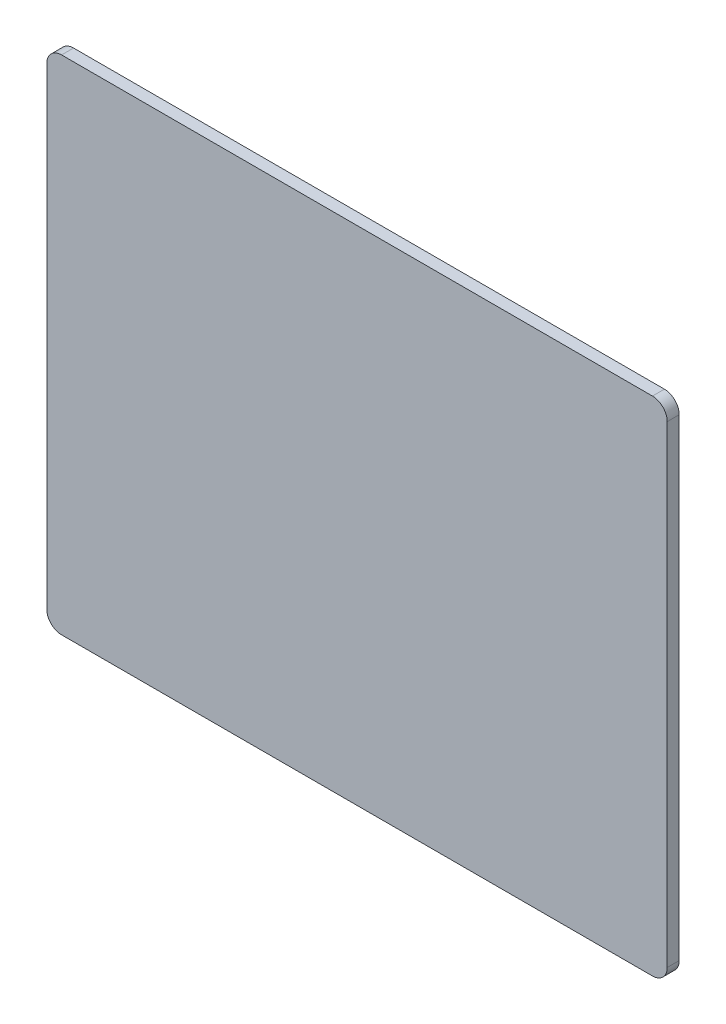
ISO-10303-21;
HEADER;
FILE_DESCRIPTION(('STEP AP214'),'2;1');
FILE_NAME('part.step','',(''),(''),'','','');
FILE_SCHEMA(('AUTOMOTIVE_DESIGN { 1 0 10303 214 1 1 1 1 }'));
ENDSEC;
DATA;
#1=APPLICATION_CONTEXT('core data for automotive mechanical design processes');
#2=APPLICATION_PROTOCOL_DEFINITION('international standard','automotive_design',2000,#1);
#3=PRODUCT_CONTEXT('',#1,'mechanical');
#4=PRODUCT('Part','Part','',(#3));
#5=PRODUCT_RELATED_PRODUCT_CATEGORY('part','',(#4));
#6=PRODUCT_DEFINITION_FORMATION('','',#4);
#7=PRODUCT_DEFINITION_CONTEXT('part definition',#1,'design');
#8=PRODUCT_DEFINITION('design','',#6,#7);
#9=PRODUCT_DEFINITION_SHAPE('','',#8);
#10=(LENGTH_UNIT() NAMED_UNIT(*) SI_UNIT(.MILLI.,.METRE.));
#11=(NAMED_UNIT(*) PLANE_ANGLE_UNIT() SI_UNIT($,.RADIAN.));
#12=(NAMED_UNIT(*) SI_UNIT($,.STERADIAN.) SOLID_ANGLE_UNIT());
#13=UNCERTAINTY_MEASURE_WITH_UNIT(LENGTH_MEASURE(1.E-05),#10,'distance_accuracy_value','');
#14=(GEOMETRIC_REPRESENTATION_CONTEXT(3) GLOBAL_UNCERTAINTY_ASSIGNED_CONTEXT((#13)) GLOBAL_UNIT_ASSIGNED_CONTEXT((#10,
#11,#12)) REPRESENTATION_CONTEXT('',''));
#15=CARTESIAN_POINT('',(0.,0.,0.));
#16=DIRECTION('',(0.,0.,1.));
#17=DIRECTION('',(1.,0.,0.));
#18=AXIS2_PLACEMENT_3D('',#15,#16,#17);
#19=CARTESIAN_POINT('',(-39.0129864614507,-38.269017284454,1.701));
#20=DIRECTION('',(0.,-1.,0.));
#21=DIRECTION('',(0.,0.,-1.));
#22=AXIS2_PLACEMENT_3D('',#19,#20,#21);
#23=PLANE('',#22);
#24=DIRECTION('',(0.,0.,1.));
#25=VECTOR('',#24,1.);
#26=CARTESIAN_POINT('',(-35.0129864614507,-38.2690172844537,0.81));
#27=LINE('',#26,#25);
#28=CARTESIAN_POINT('',(-35.0129864614507,-38.2690172844539,0.));
#29=VERTEX_POINT('',#28);
#30=CARTESIAN_POINT('',(-35.0129864614507,-38.2690172844539,1.62));
#31=VERTEX_POINT('',#30);
#32=EDGE_CURVE('E129',#29,#31,#27,.T.);
#33=ORIENTED_EDGE('',*,*,#32,.F.);
#34=DIRECTION('',(-1.,0.,0.));
#35=VECTOR('',#34,1.);
#36=CARTESIAN_POINT('',(51.1870135385495,-38.269017284454,0.));
#37=LINE('',#36,#35);
#38=CARTESIAN_POINT('',(44.9870135385494,-38.269017284454,0.));
#39=VERTEX_POINT('',#38);
#40=EDGE_CURVE('E119',#39,#29,#37,.T.);
#41=ORIENTED_EDGE('',*,*,#40,.F.);
#42=DIRECTION('',(0.,0.,-1.));
#43=VECTOR('',#42,1.);
#44=CARTESIAN_POINT('',(44.9870135385494,-38.269017284454,1.701));
#45=LINE('',#44,#43);
#46=CARTESIAN_POINT('',(44.9870135385494,-38.269017284454,1.62));
#47=VERTEX_POINT('',#46);
#48=EDGE_CURVE('E131',#39,#47,#45,.F.);
#49=ORIENTED_EDGE('',*,*,#48,.T.);
#50=DIRECTION('',(1.,0.,0.));
#51=VECTOR('',#50,1.);
#52=CARTESIAN_POINT('',(-41.2129864614505,-38.269017284454,1.62));
#53=LINE('',#52,#51);
#54=EDGE_CURVE('E121',#31,#47,#53,.T.);
#55=ORIENTED_EDGE('',*,*,#54,.F.);
#56=EDGE_LOOP('',(#33,#41,#49,#55));
#57=FACE_BOUND('',#56,.T.);
#58=ADVANCED_FACE('F17',(#57),#23,.T.);
#59=CARTESIAN_POINT('',(-35.0129864614507,-36.2690172844538,1.62));
#60=DIRECTION('',(0.,0.,1.));
#61=DIRECTION('',(1.,0.,0.));
#62=AXIS2_PLACEMENT_3D('',#59,#60,#61);
#63=CYLINDRICAL_SURFACE('',#62,1.99999999999992);
#64=CARTESIAN_POINT('',(-35.0129864614507,-36.2690172844538,0.));
#65=DIRECTION('',(0.,0.,1.));
#66=DIRECTION('',(1.,0.,0.));
#67=AXIS2_PLACEMENT_3D('',#64,#65,#66);
#68=CIRCLE('',#67,1.99999999999992);
#69=CARTESIAN_POINT('',(-37.0129864614505,-36.2690172844538,0.));
#70=VERTEX_POINT('',#69);
#71=EDGE_CURVE('E118',#29,#70,#68,.F.);
#72=ORIENTED_EDGE('',*,*,#71,.F.);
#73=ORIENTED_EDGE('',*,*,#32,.T.);
#74=CARTESIAN_POINT('',(-35.0129864614507,-36.2690172844538,1.62));
#75=DIRECTION('',(0.,0.,1.));
#76=DIRECTION('',(1.,0.,0.));
#77=AXIS2_PLACEMENT_3D('',#74,#75,#76);
#78=CIRCLE('',#77,1.99999999999992);
#79=CARTESIAN_POINT('',(-37.0129864614505,-36.2690172844538,1.62));
#80=VERTEX_POINT('',#79);
#81=EDGE_CURVE('E140',#80,#31,#78,.T.);
#82=ORIENTED_EDGE('',*,*,#81,.F.);
#83=DIRECTION('',(0.,0.,1.));
#84=VECTOR('',#83,1.);
#85=CARTESIAN_POINT('',(-37.0129864614505,-36.2690172844538,-0.0810000000000001));
#86=LINE('',#85,#84);
#87=EDGE_CURVE('E127',#70,#80,#86,.T.);
#88=ORIENTED_EDGE('',*,*,#87,.F.);
#89=EDGE_LOOP('',(#72,#73,#82,#88));
#90=FACE_BOUND('',#89,.T.);
#91=ADVANCED_FACE('F178',(#90),#63,.T.);
#92=CARTESIAN_POINT('',(-37.0129864614505,-39.469017284454,-0.0810000000000001));
#93=DIRECTION('',(-1.,0.,0.));
#94=DIRECTION('',(0.,0.,1.));
#95=AXIS2_PLACEMENT_3D('',#92,#93,#94);
#96=PLANE('',#95);
#97=ORIENTED_EDGE('',*,*,#87,.T.);
#98=DIRECTION('',(0.,1.,0.));
#99=VECTOR('',#98,1.);
#100=CARTESIAN_POINT('',(-37.0129864614505,-41.6690172844541,1.62));
#101=LINE('',#100,#99);
#102=CARTESIAN_POINT('',(-37.0129864614505,27.7309827155459,1.62));
#103=VERTEX_POINT('',#102);
#104=EDGE_CURVE('E141',#103,#80,#101,.F.);
#105=ORIENTED_EDGE('',*,*,#104,.F.);
#106=DIRECTION('',(0.,0.,1.));
#107=VECTOR('',#106,1.);
#108=CARTESIAN_POINT('',(-37.0129864614506,27.7309827155459,0.81));
#109=LINE('',#108,#107);
#110=CARTESIAN_POINT('',(-37.0129864614505,27.7309827155459,0.));
#111=VERTEX_POINT('',#110);
#112=EDGE_CURVE('E125',#111,#103,#109,.T.);
#113=ORIENTED_EDGE('',*,*,#112,.F.);
#114=DIRECTION('',(0.,1.,0.));
#115=VECTOR('',#114,1.);
#116=CARTESIAN_POINT('',(-37.0129864614505,-41.6690172844541,0.));
#117=LINE('',#116,#115);
#118=EDGE_CURVE('E115',#70,#111,#117,.T.);
#119=ORIENTED_EDGE('',*,*,#118,.F.);
#120=EDGE_LOOP('',(#97,#105,#113,#119));
#121=FACE_BOUND('',#120,.T.);
#122=ADVANCED_FACE('F175',(#121),#96,.T.);
#123=CARTESIAN_POINT('',(-35.0129864614507,27.7309827155459,1.62));
#124=DIRECTION('',(0.,0.,1.));
#125=DIRECTION('',(1.,0.,0.));
#126=AXIS2_PLACEMENT_3D('',#123,#124,#125);
#127=CYLINDRICAL_SURFACE('',#126,1.99999999999992);
#128=CARTESIAN_POINT('',(-35.0129864614507,27.7309827155459,0.));
#129=DIRECTION('',(0.,0.,1.));
#130=DIRECTION('',(1.,0.,0.));
#131=AXIS2_PLACEMENT_3D('',#128,#129,#130);
#132=CIRCLE('',#131,1.99999999999992);
#133=CARTESIAN_POINT('',(-35.0129864614507,29.7309827155461,0.));
#134=VERTEX_POINT('',#133);
#135=EDGE_CURVE('E114',#111,#134,#132,.F.);
#136=ORIENTED_EDGE('',*,*,#135,.F.);
#137=ORIENTED_EDGE('',*,*,#112,.T.);
#138=CARTESIAN_POINT('',(-35.0129864614507,27.7309827155459,1.62));
#139=DIRECTION('',(0.,0.,1.));
#140=DIRECTION('',(1.,0.,0.));
#141=AXIS2_PLACEMENT_3D('',#138,#139,#140);
#142=CIRCLE('',#141,1.99999999999992);
#143=CARTESIAN_POINT('',(-35.0129864614507,29.7309827155461,1.62));
#144=VERTEX_POINT('',#143);
#145=EDGE_CURVE('E100',#144,#103,#142,.T.);
#146=ORIENTED_EDGE('',*,*,#145,.F.);
#147=DIRECTION('',(0.,0.,1.));
#148=VECTOR('',#147,1.);
#149=CARTESIAN_POINT('',(-35.0129864614507,29.7309827155461,-0.0810000000000001));
#150=LINE('',#149,#148);
#151=EDGE_CURVE('E92',#134,#144,#150,.T.);
#152=ORIENTED_EDGE('',*,*,#151,.F.);
#153=EDGE_LOOP('',(#136,#137,#146,#152));
#154=FACE_BOUND('',#153,.T.);
#155=ADVANCED_FACE('F173',(#154),#127,.T.);
#156=CARTESIAN_POINT('',(-39.0129864614507,29.7309827155461,-0.0810000000000001));
#157=DIRECTION('',(0.,1.,0.));
#158=DIRECTION('',(0.,0.,1.));
#159=AXIS2_PLACEMENT_3D('',#156,#157,#158);
#160=PLANE('',#159);
#161=DIRECTION('',(0.,0.,1.));
#162=VECTOR('',#161,1.);
#163=CARTESIAN_POINT('',(44.9870135385494,29.730982715546,0.81));
#164=LINE('',#163,#162);
#165=CARTESIAN_POINT('',(44.9870135385494,29.7309827155461,0.));
#166=VERTEX_POINT('',#165);
#167=CARTESIAN_POINT('',(44.9870135385494,29.7309827155461,1.62));
#168=VERTEX_POINT('',#167);
#169=EDGE_CURVE('E82',#166,#168,#164,.T.);
#170=ORIENTED_EDGE('',*,*,#169,.F.);
#171=DIRECTION('',(-1.,0.,0.));
#172=VECTOR('',#171,1.);
#173=CARTESIAN_POINT('',(51.1870135385495,29.7309827155461,0.));
#174=LINE('',#173,#172);
#175=EDGE_CURVE('E112',#134,#166,#174,.F.);
#176=ORIENTED_EDGE('',*,*,#175,.F.);
#177=ORIENTED_EDGE('',*,*,#151,.T.);
#178=DIRECTION('',(1.,0.,0.));
#179=VECTOR('',#178,1.);
#180=CARTESIAN_POINT('',(-41.2129864614505,29.7309827155461,1.62));
#181=LINE('',#180,#179);
#182=EDGE_CURVE('E95',#168,#144,#181,.F.);
#183=ORIENTED_EDGE('',*,*,#182,.F.);
#184=EDGE_LOOP('',(#170,#176,#177,#183));
#185=FACE_BOUND('',#184,.T.);
#186=ADVANCED_FACE('F96',(#185),#160,.T.);
#187=CARTESIAN_POINT('',(44.9870135385494,27.7309827155459,1.62));
#188=DIRECTION('',(0.,0.,1.));
#189=DIRECTION('',(1.,0.,0.));
#190=AXIS2_PLACEMENT_3D('',#187,#188,#189);
#191=CYLINDRICAL_SURFACE('',#190,2.0000000000001);
#192=CARTESIAN_POINT('',(44.9870135385494,27.7309827155459,0.));
#193=DIRECTION('',(0.,0.,1.));
#194=DIRECTION('',(1.,0.,0.));
#195=AXIS2_PLACEMENT_3D('',#192,#193,#194);
#196=CIRCLE('',#195,2.0000000000001);
#197=CARTESIAN_POINT('',(46.9870135385495,27.7309827155459,0.));
#198=VERTEX_POINT('',#197);
#199=EDGE_CURVE('E88',#166,#198,#196,.F.);
#200=ORIENTED_EDGE('',*,*,#199,.F.);
#201=ORIENTED_EDGE('',*,*,#169,.T.);
#202=CARTESIAN_POINT('',(44.9870135385494,27.7309827155459,1.62));
#203=DIRECTION('',(0.,0.,1.));
#204=DIRECTION('',(1.,0.,0.));
#205=AXIS2_PLACEMENT_3D('',#202,#203,#204);
#206=CIRCLE('',#205,2.0000000000001);
#207=CARTESIAN_POINT('',(46.9870135385495,27.7309827155459,1.62));
#208=VERTEX_POINT('',#207);
#209=EDGE_CURVE('E21',#208,#168,#206,.T.);
#210=ORIENTED_EDGE('',*,*,#209,.F.);
#211=DIRECTION('',(0.,0.,-1.));
#212=VECTOR('',#211,1.);
#213=CARTESIAN_POINT('',(46.9870135385495,27.7309827155459,1.701));
#214=LINE('',#213,#212);
#215=EDGE_CURVE('E77',#198,#208,#214,.F.);
#216=ORIENTED_EDGE('',*,*,#215,.F.);
#217=EDGE_LOOP('',(#200,#201,#210,#216));
#218=FACE_BOUND('',#217,.T.);
#219=ADVANCED_FACE('F84',(#218),#191,.T.);
#220=CARTESIAN_POINT('',(46.9870135385495,-39.469017284454,1.701));
#221=DIRECTION('',(1.,0.,0.));
#222=DIRECTION('',(0.,0.,-1.));
#223=AXIS2_PLACEMENT_3D('',#220,#221,#222);
#224=PLANE('',#223);
#225=ORIENTED_EDGE('',*,*,#215,.T.);
#226=DIRECTION('',(0.,1.,0.));
#227=VECTOR('',#226,1.);
#228=CARTESIAN_POINT('',(46.9870135385495,-41.6690172844541,1.62));
#229=LINE('',#228,#227);
#230=CARTESIAN_POINT('',(46.9870135385495,-36.2690172844538,1.62));
#231=VERTEX_POINT('',#230);
#232=EDGE_CURVE('E105',#231,#208,#229,.T.);
#233=ORIENTED_EDGE('',*,*,#232,.F.);
#234=DIRECTION('',(0.,0.,-1.));
#235=VECTOR('',#234,1.);
#236=CARTESIAN_POINT('',(46.9870135385495,-36.2690172844538,1.701));
#237=LINE('',#236,#235);
#238=CARTESIAN_POINT('',(46.9870135385495,-36.2690172844538,0.));
#239=VERTEX_POINT('',#238);
#240=EDGE_CURVE('E36',#231,#239,#237,.T.);
#241=ORIENTED_EDGE('',*,*,#240,.T.);
#242=DIRECTION('',(0.,1.,0.));
#243=VECTOR('',#242,1.);
#244=CARTESIAN_POINT('',(46.9870135385495,-41.6690172844541,0.));
#245=LINE('',#244,#243);
#246=EDGE_CURVE('E110',#198,#239,#245,.F.);
#247=ORIENTED_EDGE('',*,*,#246,.F.);
#248=EDGE_LOOP('',(#225,#233,#241,#247));
#249=FACE_BOUND('',#248,.T.);
#250=ADVANCED_FACE('F152',(#249),#224,.T.);
#251=CARTESIAN_POINT('',(-41.2129864614505,-41.6690172844541,1.62));
#252=DIRECTION('',(0.,0.,1.));
#253=DIRECTION('',(1.,0.,0.));
#254=AXIS2_PLACEMENT_3D('',#251,#252,#253);
#255=PLANE('',#254);
#256=ORIENTED_EDGE('',*,*,#81,.T.);
#257=ORIENTED_EDGE('',*,*,#54,.T.);
#258=CARTESIAN_POINT('',(44.9870135385494,-36.2690172844538,1.62));
#259=DIRECTION('',(0.,0.,1.));
#260=DIRECTION('',(1.,0.,0.));
#261=AXIS2_PLACEMENT_3D('',#258,#259,#260);
#262=CIRCLE('',#261,2.0000000000001);
#263=EDGE_CURVE('E27',#231,#47,#262,.F.);
#264=ORIENTED_EDGE('',*,*,#263,.F.);
#265=ORIENTED_EDGE('',*,*,#232,.T.);
#266=ORIENTED_EDGE('',*,*,#209,.T.);
#267=ORIENTED_EDGE('',*,*,#182,.T.);
#268=ORIENTED_EDGE('',*,*,#145,.T.);
#269=ORIENTED_EDGE('',*,*,#104,.T.);
#270=EDGE_LOOP('',(#256,#257,#264,#265,#266,#267,#268,#269));
#271=FACE_BOUND('',#270,.T.);
#272=ADVANCED_FACE('F103',(#271),#255,.T.);
#273=CARTESIAN_POINT('',(51.1870135385495,-41.6690172844541,0.));
#274=DIRECTION('',(0.,0.,-1.));
#275=DIRECTION('',(-1.,0.,0.));
#276=AXIS2_PLACEMENT_3D('',#273,#274,#275);
#277=PLANE('',#276);
#278=ORIENTED_EDGE('',*,*,#199,.T.);
#279=ORIENTED_EDGE('',*,*,#246,.T.);
#280=CARTESIAN_POINT('',(44.9870135385494,-36.2690172844538,0.));
#281=DIRECTION('',(0.,0.,1.));
#282=DIRECTION('',(1.,0.,0.));
#283=AXIS2_PLACEMENT_3D('',#280,#281,#282);
#284=CIRCLE('',#283,2.0000000000001);
#285=EDGE_CURVE('E11',#39,#239,#284,.T.);
#286=ORIENTED_EDGE('',*,*,#285,.F.);
#287=ORIENTED_EDGE('',*,*,#40,.T.);
#288=ORIENTED_EDGE('',*,*,#71,.T.);
#289=ORIENTED_EDGE('',*,*,#118,.T.);
#290=ORIENTED_EDGE('',*,*,#135,.T.);
#291=ORIENTED_EDGE('',*,*,#175,.T.);
#292=EDGE_LOOP('',(#278,#279,#286,#287,#288,#289,#290,#291));
#293=FACE_BOUND('',#292,.T.);
#294=ADVANCED_FACE('F160',(#293),#277,.T.);
#295=CARTESIAN_POINT('',(44.9870135385494,-36.2690172844538,1.62));
#296=DIRECTION('',(0.,0.,1.));
#297=DIRECTION('',(1.,0.,0.));
#298=AXIS2_PLACEMENT_3D('',#295,#296,#297);
#299=CYLINDRICAL_SURFACE('',#298,2.0000000000001);
#300=ORIENTED_EDGE('',*,*,#285,.T.);
#301=ORIENTED_EDGE('',*,*,#240,.F.);
#302=ORIENTED_EDGE('',*,*,#263,.T.);
#303=ORIENTED_EDGE('',*,*,#48,.F.);
#304=EDGE_LOOP('',(#300,#301,#302,#303));
#305=FACE_BOUND('',#304,.T.);
#306=ADVANCED_FACE('F19',(#305),#299,.T.);
#307=CLOSED_SHELL('',(#58,#91,#122,#155,#186,#219,#250,#272,#294,#306));
#308=MANIFOLD_SOLID_BREP('B1',#307);
#309=ADVANCED_BREP_SHAPE_REPRESENTATION('',(#18,#308),#14);
#310=SHAPE_DEFINITION_REPRESENTATION(#9,#309);
ENDSEC;
END-ISO-10303-21;
